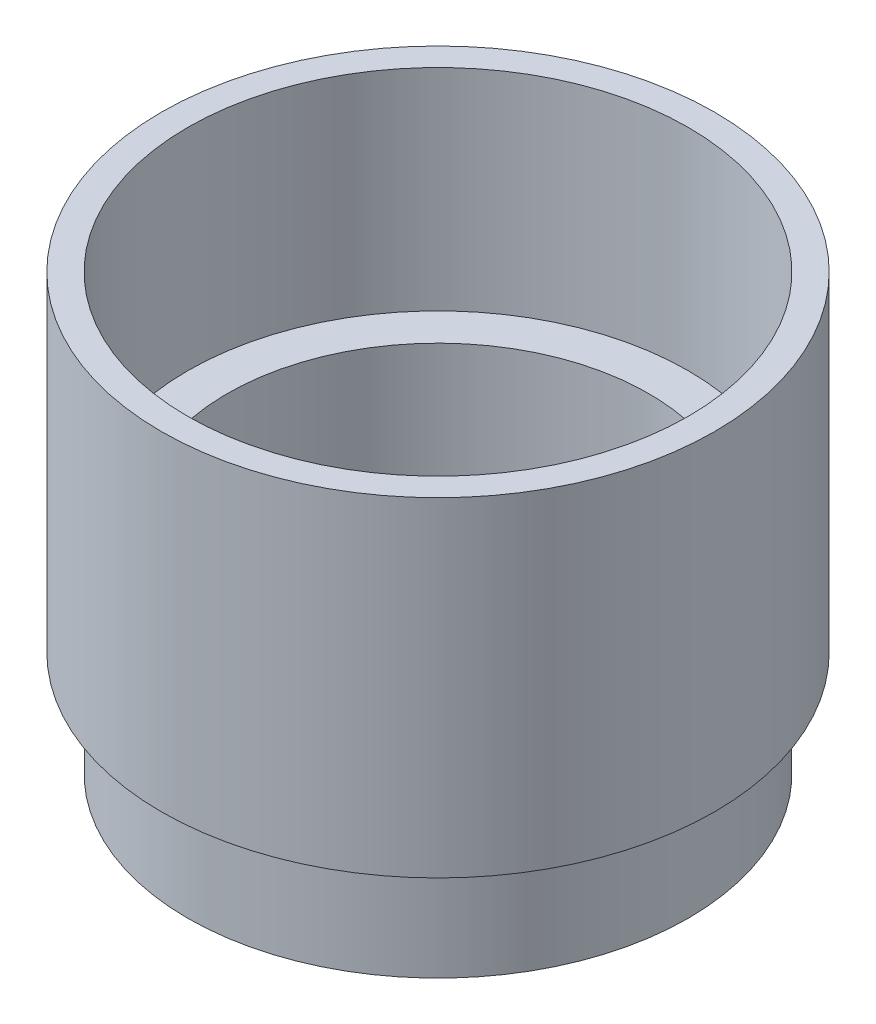
ISO-10303-21;
HEADER;
FILE_DESCRIPTION(('STEP AP214'),'2;1');
FILE_NAME('part.step','',(''),(''),'','','');
FILE_SCHEMA(('AUTOMOTIVE_DESIGN { 1 0 10303 214 1 1 1 1 }'));
ENDSEC;
DATA;
#1=APPLICATION_CONTEXT('core data for automotive mechanical design processes');
#2=APPLICATION_PROTOCOL_DEFINITION('international standard','automotive_design',2000,#1);
#3=PRODUCT_CONTEXT('',#1,'mechanical');
#4=PRODUCT('Part','Part','',(#3));
#5=PRODUCT_RELATED_PRODUCT_CATEGORY('part','',(#4));
#6=PRODUCT_DEFINITION_FORMATION('','',#4);
#7=PRODUCT_DEFINITION_CONTEXT('part definition',#1,'design');
#8=PRODUCT_DEFINITION('design','',#6,#7);
#9=PRODUCT_DEFINITION_SHAPE('','',#8);
#10=(LENGTH_UNIT() NAMED_UNIT(*) SI_UNIT(.MILLI.,.METRE.));
#11=(NAMED_UNIT(*) PLANE_ANGLE_UNIT() SI_UNIT($,.RADIAN.));
#12=(NAMED_UNIT(*) SI_UNIT($,.STERADIAN.) SOLID_ANGLE_UNIT());
#13=UNCERTAINTY_MEASURE_WITH_UNIT(LENGTH_MEASURE(1.E-05),#10,'distance_accuracy_value','');
#14=(GEOMETRIC_REPRESENTATION_CONTEXT(3) GLOBAL_UNCERTAINTY_ASSIGNED_CONTEXT((#13)) GLOBAL_UNIT_ASSIGNED_CONTEXT((#10,
#11,#12)) REPRESENTATION_CONTEXT('',''));
#15=CARTESIAN_POINT('',(0.,0.,0.));
#16=DIRECTION('',(0.,0.,1.));
#17=DIRECTION('',(1.,0.,0.));
#18=AXIS2_PLACEMENT_3D('',#15,#16,#17);
#19=CARTESIAN_POINT('',(0.,0.,0.));
#20=DIRECTION('',(0.,-1.,0.));
#21=DIRECTION('',(0.,0.,-1.));
#22=AXIS2_PLACEMENT_3D('',#19,#20,#21);
#23=PLANE('',#22);
#24=CARTESIAN_POINT('',(0.,0.,0.));
#25=DIRECTION('',(0.,1.,0.));
#26=DIRECTION('',(0.,0.,1.));
#27=AXIS2_PLACEMENT_3D('',#24,#25,#26);
#28=CIRCLE('',#27,25.4);
#29=CARTESIAN_POINT('',(0.,0.,25.4));
#30=VERTEX_POINT('',#29);
#31=EDGE_CURVE('E152',#30,#30,#28,.T.);
#32=ORIENTED_EDGE('',*,*,#31,.T.);
#33=EDGE_LOOP('',(#32));
#34=FACE_BOUND('',#33,.T.);
#35=DIRECTION('',(0.,0.,-1.));
#36=VECTOR('',#35,1.);
#37=CARTESIAN_POINT('',(19.05,0.,-9.525));
#38=LINE('',#37,#36);
#39=CARTESIAN_POINT('',(19.05,0.,4.7625));
#40=VERTEX_POINT('',#39);
#41=CARTESIAN_POINT('',(19.05,0.,-4.7625));
#42=VERTEX_POINT('',#41);
#43=EDGE_CURVE('E126',#40,#42,#38,.T.);
#44=ORIENTED_EDGE('',*,*,#43,.F.);
#45=CARTESIAN_POINT('',(14.2875,0.,4.7625));
#46=DIRECTION('',(0.,-1.,0.));
#47=DIRECTION('',(0.,0.,-1.));
#48=AXIS2_PLACEMENT_3D('',#45,#46,#47);
#49=CIRCLE('',#48,4.7625);
#50=CARTESIAN_POINT('',(14.2875,0.,9.525));
#51=VERTEX_POINT('',#50);
#52=EDGE_CURVE('E43',#40,#51,#49,.T.);
#53=ORIENTED_EDGE('',*,*,#52,.T.);
#54=DIRECTION('',(1.,0.,0.));
#55=VECTOR('',#54,1.);
#56=CARTESIAN_POINT('',(19.05,0.,9.525));
#57=LINE('',#56,#55);
#58=CARTESIAN_POINT('',(-14.2875,0.,9.52500000000001));
#59=VERTEX_POINT('',#58);
#60=EDGE_CURVE('E121',#59,#51,#57,.T.);
#61=ORIENTED_EDGE('',*,*,#60,.F.);
#62=CARTESIAN_POINT('',(-14.2875,0.,4.7625));
#63=DIRECTION('',(0.,-1.,0.));
#64=DIRECTION('',(0.,0.,-1.));
#65=AXIS2_PLACEMENT_3D('',#62,#63,#64);
#66=CIRCLE('',#65,4.7625);
#67=CARTESIAN_POINT('',(-19.05,0.,4.7625));
#68=VERTEX_POINT('',#67);
#69=EDGE_CURVE('E11',#59,#68,#66,.T.);
#70=ORIENTED_EDGE('',*,*,#69,.T.);
#71=DIRECTION('',(0.,0.,1.));
#72=VECTOR('',#71,1.);
#73=CARTESIAN_POINT('',(-19.05,0.,-9.525));
#74=LINE('',#73,#72);
#75=CARTESIAN_POINT('',(-19.05,0.,-4.7625));
#76=VERTEX_POINT('',#75);
#77=EDGE_CURVE('E115',#76,#68,#74,.T.);
#78=ORIENTED_EDGE('',*,*,#77,.F.);
#79=CARTESIAN_POINT('',(-14.2875,0.,-4.7625));
#80=DIRECTION('',(0.,-1.,0.));
#81=DIRECTION('',(0.,0.,-1.));
#82=AXIS2_PLACEMENT_3D('',#79,#80,#81);
#83=CIRCLE('',#82,4.7625);
#84=CARTESIAN_POINT('',(-14.2875,0.,-9.525));
#85=VERTEX_POINT('',#84);
#86=EDGE_CURVE('E99',#76,#85,#83,.T.);
#87=ORIENTED_EDGE('',*,*,#86,.T.);
#88=DIRECTION('',(-1.,0.,0.));
#89=VECTOR('',#88,1.);
#90=CARTESIAN_POINT('',(19.05,0.,-9.525));
#91=LINE('',#90,#89);
#92=CARTESIAN_POINT('',(14.2875,0.,-9.525));
#93=VERTEX_POINT('',#92);
#94=EDGE_CURVE('E122',#93,#85,#91,.T.);
#95=ORIENTED_EDGE('',*,*,#94,.F.);
#96=CARTESIAN_POINT('',(14.2875,0.,-4.7625));
#97=DIRECTION('',(0.,-1.,0.));
#98=DIRECTION('',(0.,0.,-1.));
#99=AXIS2_PLACEMENT_3D('',#96,#97,#98);
#100=CIRCLE('',#99,4.7625);
#101=EDGE_CURVE('E108',#93,#42,#100,.T.);
#102=ORIENTED_EDGE('',*,*,#101,.T.);
#103=EDGE_LOOP('',(#44,#53,#61,#70,#78,#87,#95,#102));
#104=FACE_BOUND('',#103,.T.);
#105=ADVANCED_FACE('F35',(#34,#104),#23,.F.);
#106=CARTESIAN_POINT('',(0.,0.,0.));
#107=DIRECTION('',(0.,1.,0.));
#108=DIRECTION('',(0.,0.,1.));
#109=AXIS2_PLACEMENT_3D('',#106,#107,#108);
#110=CYLINDRICAL_SURFACE('',#109,25.4);
#111=ORIENTED_EDGE('',*,*,#31,.F.);
#112=EDGE_LOOP('',(#111));
#113=FACE_BOUND('',#112,.T.);
#114=CARTESIAN_POINT('',(0.,19.05,0.));
#115=DIRECTION('',(0.,1.,0.));
#116=DIRECTION('',(0.,0.,1.));
#117=AXIS2_PLACEMENT_3D('',#114,#115,#116);
#118=CIRCLE('',#117,25.4);
#119=CARTESIAN_POINT('',(0.,19.05,25.4));
#120=VERTEX_POINT('',#119);
#121=EDGE_CURVE('E149',#120,#120,#118,.T.);
#122=ORIENTED_EDGE('',*,*,#121,.T.);
#123=EDGE_LOOP('',(#122));
#124=FACE_BOUND('',#123,.T.);
#125=ADVANCED_FACE('F211',(#113,#124),#110,.F.);
#126=CARTESIAN_POINT('',(25.4,19.05,0.));
#127=DIRECTION('',(0.,-1.,0.));
#128=DIRECTION('',(0.,0.,-1.));
#129=AXIS2_PLACEMENT_3D('',#126,#127,#128);
#130=PLANE('',#129);
#131=ORIENTED_EDGE('',*,*,#121,.F.);
#132=EDGE_LOOP('',(#131));
#133=FACE_BOUND('',#132,.T.);
#134=CARTESIAN_POINT('',(0.,19.05,0.));
#135=DIRECTION('',(0.,1.,0.));
#136=DIRECTION('',(0.,0.,1.));
#137=AXIS2_PLACEMENT_3D('',#134,#135,#136);
#138=CIRCLE('',#137,30.1625);
#139=CARTESIAN_POINT('',(0.,19.05,30.1625));
#140=VERTEX_POINT('',#139);
#141=EDGE_CURVE('E146',#140,#140,#138,.T.);
#142=ORIENTED_EDGE('',*,*,#141,.T.);
#143=EDGE_LOOP('',(#142));
#144=FACE_BOUND('',#143,.T.);
#145=ADVANCED_FACE('F217',(#133,#144),#130,.F.);
#146=CARTESIAN_POINT('',(0.,0.,0.));
#147=DIRECTION('',(0.,1.,0.));
#148=DIRECTION('',(0.,0.,1.));
#149=AXIS2_PLACEMENT_3D('',#146,#147,#148);
#150=CYLINDRICAL_SURFACE('',#149,30.1625);
#151=ORIENTED_EDGE('',*,*,#141,.F.);
#152=EDGE_LOOP('',(#151));
#153=FACE_BOUND('',#152,.T.);
#154=CARTESIAN_POINT('',(0.,44.45,0.));
#155=DIRECTION('',(0.,1.,0.));
#156=DIRECTION('',(0.,0.,1.));
#157=AXIS2_PLACEMENT_3D('',#154,#155,#156);
#158=CIRCLE('',#157,30.1625);
#159=CARTESIAN_POINT('',(0.,44.45,30.1625));
#160=VERTEX_POINT('',#159);
#161=EDGE_CURVE('E143',#160,#160,#158,.T.);
#162=ORIENTED_EDGE('',*,*,#161,.T.);
#163=EDGE_LOOP('',(#162));
#164=FACE_BOUND('',#163,.T.);
#165=ADVANCED_FACE('F329',(#153,#164),#150,.F.);
#166=CARTESIAN_POINT('',(30.1625,44.45,0.));
#167=DIRECTION('',(0.,-1.,0.));
#168=DIRECTION('',(0.,0.,-1.));
#169=AXIS2_PLACEMENT_3D('',#166,#167,#168);
#170=PLANE('',#169);
#171=ORIENTED_EDGE('',*,*,#161,.F.);
#172=EDGE_LOOP('',(#171));
#173=FACE_BOUND('',#172,.T.);
#174=CARTESIAN_POINT('',(0.,44.45,0.));
#175=DIRECTION('',(0.,1.,0.));
#176=DIRECTION('',(0.,0.,1.));
#177=AXIS2_PLACEMENT_3D('',#174,#175,#176);
#178=CIRCLE('',#177,33.3375);
#179=CARTESIAN_POINT('',(0.,44.45,33.3375));
#180=VERTEX_POINT('',#179);
#181=EDGE_CURVE('E140',#180,#180,#178,.T.);
#182=ORIENTED_EDGE('',*,*,#181,.T.);
#183=EDGE_LOOP('',(#182));
#184=FACE_BOUND('',#183,.T.);
#185=ADVANCED_FACE('F320',(#173,#184),#170,.F.);
#186=CARTESIAN_POINT('',(0.,0.,0.));
#187=DIRECTION('',(0.,1.,0.));
#188=DIRECTION('',(0.,0.,1.));
#189=AXIS2_PLACEMENT_3D('',#186,#187,#188);
#190=CYLINDRICAL_SURFACE('',#189,33.3375);
#191=ORIENTED_EDGE('',*,*,#181,.F.);
#192=EDGE_LOOP('',(#191));
#193=FACE_BOUND('',#192,.T.);
#194=CARTESIAN_POINT('',(0.,4.7625,0.));
#195=DIRECTION('',(0.,1.,0.));
#196=DIRECTION('',(0.,0.,1.));
#197=AXIS2_PLACEMENT_3D('',#194,#195,#196);
#198=CIRCLE('',#197,33.3375);
#199=CARTESIAN_POINT('',(0.,4.7625,33.3375));
#200=VERTEX_POINT('',#199);
#201=EDGE_CURVE('E137',#200,#200,#198,.T.);
#202=ORIENTED_EDGE('',*,*,#201,.T.);
#203=EDGE_LOOP('',(#202));
#204=FACE_BOUND('',#203,.T.);
#205=ADVANCED_FACE('F311',(#193,#204),#190,.T.);
#206=CARTESIAN_POINT('',(33.3375,4.7625,0.));
#207=DIRECTION('',(0.,1.,0.));
#208=DIRECTION('',(0.,0.,1.));
#209=AXIS2_PLACEMENT_3D('',#206,#207,#208);
#210=PLANE('',#209);
#211=ORIENTED_EDGE('',*,*,#201,.F.);
#212=EDGE_LOOP('',(#211));
#213=FACE_BOUND('',#212,.T.);
#214=CARTESIAN_POINT('',(0.,4.7625,0.));
#215=DIRECTION('',(0.,1.,0.));
#216=DIRECTION('',(0.,0.,1.));
#217=AXIS2_PLACEMENT_3D('',#214,#215,#216);
#218=CIRCLE('',#217,30.1625);
#219=CARTESIAN_POINT('',(0.,4.7625,30.1625));
#220=VERTEX_POINT('',#219);
#221=EDGE_CURVE('E133',#220,#220,#218,.T.);
#222=ORIENTED_EDGE('',*,*,#221,.T.);
#223=EDGE_LOOP('',(#222));
#224=FACE_BOUND('',#223,.T.);
#225=ADVANCED_FACE('F302',(#213,#224),#210,.F.);
#226=CARTESIAN_POINT('',(0.,0.,0.));
#227=DIRECTION('',(0.,1.,0.));
#228=DIRECTION('',(0.,0.,1.));
#229=AXIS2_PLACEMENT_3D('',#226,#227,#228);
#230=CYLINDRICAL_SURFACE('',#229,30.1625);
#231=ORIENTED_EDGE('',*,*,#221,.F.);
#232=EDGE_LOOP('',(#231));
#233=FACE_BOUND('',#232,.T.);
#234=CARTESIAN_POINT('',(0.,-7.9375,0.));
#235=DIRECTION('',(0.,1.,0.));
#236=DIRECTION('',(0.,0.,1.));
#237=AXIS2_PLACEMENT_3D('',#234,#235,#236);
#238=CIRCLE('',#237,30.1625);
#239=CARTESIAN_POINT('',(0.,-7.9375,30.1625));
#240=VERTEX_POINT('',#239);
#241=EDGE_CURVE('E130',#240,#240,#238,.T.);
#242=ORIENTED_EDGE('',*,*,#241,.T.);
#243=EDGE_LOOP('',(#242));
#244=FACE_BOUND('',#243,.T.);
#245=ADVANCED_FACE('F293',(#233,#244),#230,.T.);
#246=CARTESIAN_POINT('',(30.1625,-7.9375,0.));
#247=DIRECTION('',(0.,1.,0.));
#248=DIRECTION('',(0.,0.,1.));
#249=AXIS2_PLACEMENT_3D('',#246,#247,#248);
#250=PLANE('',#249);
#251=ORIENTED_EDGE('',*,*,#241,.F.);
#252=EDGE_LOOP('',(#251));
#253=FACE_BOUND('',#252,.T.);
#254=ADVANCED_FACE('F281',(#253),#250,.F.);
#255=CARTESIAN_POINT('',(19.05,-5.08,-9.525));
#256=DIRECTION('',(1.,0.,0.));
#257=DIRECTION('',(0.,0.,-1.));
#258=AXIS2_PLACEMENT_3D('',#255,#256,#257);
#259=PLANE('',#258);
#260=ORIENTED_EDGE('',*,*,#43,.T.);
#261=DIRECTION('',(0.,1.,0.));
#262=VECTOR('',#261,1.);
#263=CARTESIAN_POINT('',(19.05,-5.08,-4.7625));
#264=LINE('',#263,#262);
#265=CARTESIAN_POINT('',(19.05,-5.08,-4.7625));
#266=VERTEX_POINT('',#265);
#267=EDGE_CURVE('E170',#42,#266,#264,.F.);
#268=ORIENTED_EDGE('',*,*,#267,.T.);
#269=DIRECTION('',(0.,0.,-1.));
#270=VECTOR('',#269,1.);
#271=CARTESIAN_POINT('',(19.05,-5.08,-9.525));
#272=LINE('',#271,#270);
#273=CARTESIAN_POINT('',(19.05,-5.08,4.7625));
#274=VERTEX_POINT('',#273);
#275=EDGE_CURVE('E124',#274,#266,#272,.T.);
#276=ORIENTED_EDGE('',*,*,#275,.F.);
#277=DIRECTION('',(0.,1.,0.));
#278=VECTOR('',#277,1.);
#279=CARTESIAN_POINT('',(19.05,0.,4.7625));
#280=LINE('',#279,#278);
#281=EDGE_CURVE('E167',#274,#40,#280,.T.);
#282=ORIENTED_EDGE('',*,*,#281,.T.);
#283=EDGE_LOOP('',(#260,#268,#276,#282));
#284=FACE_BOUND('',#283,.T.);
#285=ADVANCED_FACE('F180',(#284),#259,.F.);
#286=CARTESIAN_POINT('',(19.05,-5.08,9.525));
#287=DIRECTION('',(0.,0.,1.));
#288=DIRECTION('',(1.,0.,0.));
#289=AXIS2_PLACEMENT_3D('',#286,#287,#288);
#290=PLANE('',#289);
#291=ORIENTED_EDGE('',*,*,#60,.T.);
#292=DIRECTION('',(0.,1.,0.));
#293=VECTOR('',#292,1.);
#294=CARTESIAN_POINT('',(14.2875,-5.08,9.525));
#295=LINE('',#294,#293);
#296=CARTESIAN_POINT('',(14.2875,-5.08,9.525));
#297=VERTEX_POINT('',#296);
#298=EDGE_CURVE('E109',#51,#297,#295,.F.);
#299=ORIENTED_EDGE('',*,*,#298,.T.);
#300=DIRECTION('',(1.,0.,0.));
#301=VECTOR('',#300,1.);
#302=CARTESIAN_POINT('',(19.05,-5.08,9.525));
#303=LINE('',#302,#301);
#304=CARTESIAN_POINT('',(-14.2875,-5.08,9.52500000000001));
#305=VERTEX_POINT('',#304);
#306=EDGE_CURVE('E134',#305,#297,#303,.T.);
#307=ORIENTED_EDGE('',*,*,#306,.F.);
#308=DIRECTION('',(0.,1.,0.));
#309=VECTOR('',#308,1.);
#310=CARTESIAN_POINT('',(-14.2875,0.,9.52500000000001));
#311=LINE('',#310,#309);
#312=EDGE_CURVE('E172',#305,#59,#311,.T.);
#313=ORIENTED_EDGE('',*,*,#312,.T.);
#314=EDGE_LOOP('',(#291,#299,#307,#313));
#315=FACE_BOUND('',#314,.T.);
#316=ADVANCED_FACE('F205',(#315),#290,.F.);
#317=CARTESIAN_POINT('',(-19.05,-5.08,-9.525));
#318=DIRECTION('',(-1.,0.,0.));
#319=DIRECTION('',(0.,0.,1.));
#320=AXIS2_PLACEMENT_3D('',#317,#318,#319);
#321=PLANE('',#320);
#322=DIRECTION('',(0.,0.,1.));
#323=VECTOR('',#322,1.);
#324=CARTESIAN_POINT('',(-19.05,-5.08,-9.525));
#325=LINE('',#324,#323);
#326=CARTESIAN_POINT('',(-19.05,-5.08,-4.7625));
#327=VERTEX_POINT('',#326);
#328=CARTESIAN_POINT('',(-19.05,-5.08,4.7625));
#329=VERTEX_POINT('',#328);
#330=EDGE_CURVE('E117',#327,#329,#325,.T.);
#331=ORIENTED_EDGE('',*,*,#330,.F.);
#332=DIRECTION('',(0.,1.,0.));
#333=VECTOR('',#332,1.);
#334=CARTESIAN_POINT('',(-19.05,0.,-4.76249999999999));
#335=LINE('',#334,#333);
#336=EDGE_CURVE('E103',#327,#76,#335,.T.);
#337=ORIENTED_EDGE('',*,*,#336,.T.);
#338=ORIENTED_EDGE('',*,*,#77,.T.);
#339=DIRECTION('',(0.,1.,0.));
#340=VECTOR('',#339,1.);
#341=CARTESIAN_POINT('',(-19.05,-5.08,4.76250000000001));
#342=LINE('',#341,#340);
#343=EDGE_CURVE('E119',#68,#329,#342,.F.);
#344=ORIENTED_EDGE('',*,*,#343,.T.);
#345=EDGE_LOOP('',(#331,#337,#338,#344));
#346=FACE_BOUND('',#345,.T.);
#347=ADVANCED_FACE('F114',(#346),#321,.F.);
#348=CARTESIAN_POINT('',(19.05,-5.08,-9.525));
#349=DIRECTION('',(0.,0.,-1.));
#350=DIRECTION('',(-1.,0.,0.));
#351=AXIS2_PLACEMENT_3D('',#348,#349,#350);
#352=PLANE('',#351);
#353=ORIENTED_EDGE('',*,*,#94,.T.);
#354=DIRECTION('',(0.,1.,0.));
#355=VECTOR('',#354,1.);
#356=CARTESIAN_POINT('',(-14.2875,-5.08,-9.525));
#357=LINE('',#356,#355);
#358=CARTESIAN_POINT('',(-14.2875,-5.08,-9.525));
#359=VERTEX_POINT('',#358);
#360=EDGE_CURVE('E104',#85,#359,#357,.F.);
#361=ORIENTED_EDGE('',*,*,#360,.T.);
#362=DIRECTION('',(-1.,0.,0.));
#363=VECTOR('',#362,1.);
#364=CARTESIAN_POINT('',(19.05,-5.08,-9.525));
#365=LINE('',#364,#363);
#366=CARTESIAN_POINT('',(14.2875,-5.08,-9.525));
#367=VERTEX_POINT('',#366);
#368=EDGE_CURVE('E190',#367,#359,#365,.T.);
#369=ORIENTED_EDGE('',*,*,#368,.F.);
#370=DIRECTION('',(0.,1.,0.));
#371=VECTOR('',#370,1.);
#372=CARTESIAN_POINT('',(14.2875,0.,-9.525));
#373=LINE('',#372,#371);
#374=EDGE_CURVE('E118',#367,#93,#373,.T.);
#375=ORIENTED_EDGE('',*,*,#374,.T.);
#376=EDGE_LOOP('',(#353,#361,#369,#375));
#377=FACE_BOUND('',#376,.T.);
#378=ADVANCED_FACE('F192',(#377),#352,.F.);
#379=CARTESIAN_POINT('',(0.,-5.08,0.));
#380=DIRECTION('',(0.,-1.,0.));
#381=DIRECTION('',(0.,0.,-1.));
#382=AXIS2_PLACEMENT_3D('',#379,#380,#381);
#383=PLANE('',#382);
#384=ORIENTED_EDGE('',*,*,#368,.T.);
#385=CARTESIAN_POINT('',(-14.2875,-5.08,-4.7625));
#386=DIRECTION('',(0.,-1.,0.));
#387=DIRECTION('',(0.,0.,-1.));
#388=AXIS2_PLACEMENT_3D('',#385,#386,#387);
#389=CIRCLE('',#388,4.7625);
#390=EDGE_CURVE('E165',#359,#327,#389,.F.);
#391=ORIENTED_EDGE('',*,*,#390,.T.);
#392=ORIENTED_EDGE('',*,*,#330,.T.);
#393=CARTESIAN_POINT('',(-14.2875,-5.08,4.7625));
#394=DIRECTION('',(0.,-1.,0.));
#395=DIRECTION('',(0.,0.,-1.));
#396=AXIS2_PLACEMENT_3D('',#393,#394,#395);
#397=CIRCLE('',#396,4.7625);
#398=EDGE_CURVE('E159',#329,#305,#397,.F.);
#399=ORIENTED_EDGE('',*,*,#398,.T.);
#400=ORIENTED_EDGE('',*,*,#306,.T.);
#401=CARTESIAN_POINT('',(14.2875,-5.08,4.7625));
#402=DIRECTION('',(0.,-1.,0.));
#403=DIRECTION('',(0.,0.,-1.));
#404=AXIS2_PLACEMENT_3D('',#401,#402,#403);
#405=CIRCLE('',#404,4.7625);
#406=EDGE_CURVE('E161',#297,#274,#405,.F.);
#407=ORIENTED_EDGE('',*,*,#406,.T.);
#408=ORIENTED_EDGE('',*,*,#275,.T.);
#409=CARTESIAN_POINT('',(14.2875,-5.08,-4.7625));
#410=DIRECTION('',(0.,-1.,0.));
#411=DIRECTION('',(0.,0.,-1.));
#412=AXIS2_PLACEMENT_3D('',#409,#410,#411);
#413=CIRCLE('',#412,4.7625);
#414=EDGE_CURVE('E163',#266,#367,#413,.F.);
#415=ORIENTED_EDGE('',*,*,#414,.T.);
#416=EDGE_LOOP('',(#384,#391,#392,#399,#400,#407,#408,#415));
#417=FACE_BOUND('',#416,.T.);
#418=ADVANCED_FACE('F189',(#417),#383,.F.);
#419=CARTESIAN_POINT('',(-14.2875,-5.08,-4.7625));
#420=DIRECTION('',(0.,-1.,0.));
#421=DIRECTION('',(0.,0.,-1.));
#422=AXIS2_PLACEMENT_3D('',#419,#420,#421);
#423=CYLINDRICAL_SURFACE('',#422,4.7625);
#424=ORIENTED_EDGE('',*,*,#390,.F.);
#425=ORIENTED_EDGE('',*,*,#360,.F.);
#426=ORIENTED_EDGE('',*,*,#86,.F.);
#427=ORIENTED_EDGE('',*,*,#336,.F.);
#428=EDGE_LOOP('',(#424,#425,#426,#427));
#429=FACE_BOUND('',#428,.T.);
#430=ADVANCED_FACE('F102',(#429),#423,.F.);
#431=CARTESIAN_POINT('',(14.2875,-5.08,-4.7625));
#432=DIRECTION('',(0.,-1.,0.));
#433=DIRECTION('',(0.,0.,-1.));
#434=AXIS2_PLACEMENT_3D('',#431,#432,#433);
#435=CYLINDRICAL_SURFACE('',#434,4.7625);
#436=ORIENTED_EDGE('',*,*,#414,.F.);
#437=ORIENTED_EDGE('',*,*,#267,.F.);
#438=ORIENTED_EDGE('',*,*,#101,.F.);
#439=ORIENTED_EDGE('',*,*,#374,.F.);
#440=EDGE_LOOP('',(#436,#437,#438,#439));
#441=FACE_BOUND('',#440,.T.);
#442=ADVANCED_FACE('F185',(#441),#435,.F.);
#443=CARTESIAN_POINT('',(14.2875,-5.08,4.7625));
#444=DIRECTION('',(0.,-1.,0.));
#445=DIRECTION('',(0.,0.,-1.));
#446=AXIS2_PLACEMENT_3D('',#443,#444,#445);
#447=CYLINDRICAL_SURFACE('',#446,4.7625);
#448=ORIENTED_EDGE('',*,*,#406,.F.);
#449=ORIENTED_EDGE('',*,*,#298,.F.);
#450=ORIENTED_EDGE('',*,*,#52,.F.);
#451=ORIENTED_EDGE('',*,*,#281,.F.);
#452=EDGE_LOOP('',(#448,#449,#450,#451));
#453=FACE_BOUND('',#452,.T.);
#454=ADVANCED_FACE('F204',(#453),#447,.F.);
#455=CARTESIAN_POINT('',(-14.2875,-5.08,4.7625));
#456=DIRECTION('',(0.,-1.,0.));
#457=DIRECTION('',(0.,0.,-1.));
#458=AXIS2_PLACEMENT_3D('',#455,#456,#457);
#459=CYLINDRICAL_SURFACE('',#458,4.7625);
#460=ORIENTED_EDGE('',*,*,#398,.F.);
#461=ORIENTED_EDGE('',*,*,#343,.F.);
#462=ORIENTED_EDGE('',*,*,#69,.F.);
#463=ORIENTED_EDGE('',*,*,#312,.F.);
#464=EDGE_LOOP('',(#460,#461,#462,#463));
#465=FACE_BOUND('',#464,.T.);
#466=ADVANCED_FACE('F37',(#465),#459,.F.);
#467=CLOSED_SHELL('',(#105,#125,#145,#165,#185,#205,#225,#245,#254,#285,#316,#347,#378,#418,
#430,#442,#454,#466));
#468=MANIFOLD_SOLID_BREP('B2',#467);
#469=ADVANCED_BREP_SHAPE_REPRESENTATION('',(#18,#468),#14);
#470=SHAPE_DEFINITION_REPRESENTATION(#9,#469);
ENDSEC;
END-ISO-10303-21;
